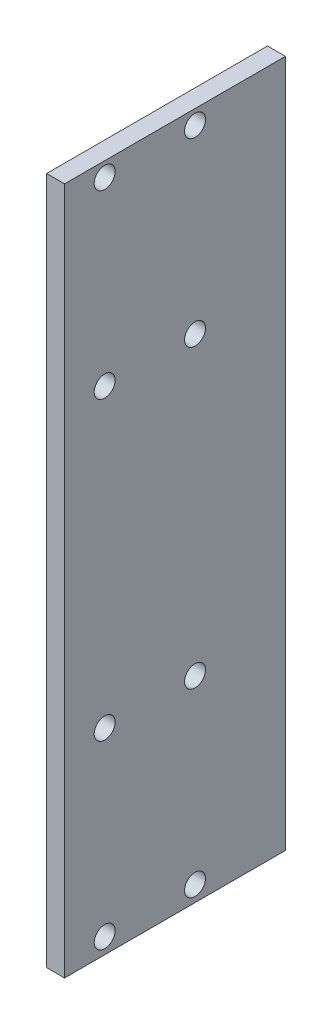
ISO-10303-21;
HEADER;
FILE_DESCRIPTION(('STEP AP214'),'2;1');
FILE_NAME('part.step','',(''),(''),'','','');
FILE_SCHEMA(('AUTOMOTIVE_DESIGN { 1 0 10303 214 1 1 1 1 }'));
ENDSEC;
DATA;
#1=APPLICATION_CONTEXT('core data for automotive mechanical design processes');
#2=APPLICATION_PROTOCOL_DEFINITION('international standard','automotive_design',2000,#1);
#3=PRODUCT_CONTEXT('',#1,'mechanical');
#4=PRODUCT('Part','Part','',(#3));
#5=PRODUCT_RELATED_PRODUCT_CATEGORY('part','',(#4));
#6=PRODUCT_DEFINITION_FORMATION('','',#4);
#7=PRODUCT_DEFINITION_CONTEXT('part definition',#1,'design');
#8=PRODUCT_DEFINITION('design','',#6,#7);
#9=PRODUCT_DEFINITION_SHAPE('','',#8);
#10=(LENGTH_UNIT() NAMED_UNIT(*) SI_UNIT(.MILLI.,.METRE.));
#11=(NAMED_UNIT(*) PLANE_ANGLE_UNIT() SI_UNIT($,.RADIAN.));
#12=(NAMED_UNIT(*) SI_UNIT($,.STERADIAN.) SOLID_ANGLE_UNIT());
#13=UNCERTAINTY_MEASURE_WITH_UNIT(LENGTH_MEASURE(1.E-05),#10,'distance_accuracy_value','');
#14=(GEOMETRIC_REPRESENTATION_CONTEXT(3) GLOBAL_UNCERTAINTY_ASSIGNED_CONTEXT((#13)) GLOBAL_UNIT_ASSIGNED_CONTEXT((#10,
#11,#12)) REPRESENTATION_CONTEXT('',''));
#15=CARTESIAN_POINT('',(0.,0.,0.));
#16=DIRECTION('',(0.,0.,1.));
#17=DIRECTION('',(1.,0.,0.));
#18=AXIS2_PLACEMENT_3D('',#15,#16,#17);
#19=CARTESIAN_POINT('',(3.175,0.,0.));
#20=DIRECTION('',(-1.,0.,0.));
#21=DIRECTION('',(0.,0.,1.));
#22=AXIS2_PLACEMENT_3D('',#19,#20,#21);
#23=PLANE('',#22);
#24=DIRECTION('',(0.,-1.,0.));
#25=VECTOR('',#24,1.);
#26=CARTESIAN_POINT('',(3.175,-18.795999999999,82.));
#27=LINE('',#26,#25);
#28=CARTESIAN_POINT('',(3.175,103.,82.));
#29=VERTEX_POINT('',#28);
#30=CARTESIAN_POINT('',(3.175,-18.795999999999,82.));
#31=VERTEX_POINT('',#30);
#32=EDGE_CURVE('E85',#29,#31,#27,.T.);
#33=ORIENTED_EDGE('',*,*,#32,.T.);
#34=DIRECTION('',(0.,0.,-1.));
#35=VECTOR('',#34,1.);
#36=CARTESIAN_POINT('',(3.175,-18.795999999999,82.));
#37=LINE('',#36,#35);
#38=CARTESIAN_POINT('',(3.175,-18.795999999999,42.8868));
#39=VERTEX_POINT('',#38);
#40=EDGE_CURVE('E80',#31,#39,#37,.T.);
#41=ORIENTED_EDGE('',*,*,#40,.T.);
#42=DIRECTION('',(0.,1.,0.));
#43=VECTOR('',#42,1.);
#44=CARTESIAN_POINT('',(3.175,-18.795999999999,42.8868));
#45=LINE('',#44,#43);
#46=CARTESIAN_POINT('',(3.175,103.,42.8868));
#47=VERTEX_POINT('',#46);
#48=EDGE_CURVE('E83',#39,#47,#45,.T.);
#49=ORIENTED_EDGE('',*,*,#48,.T.);
#50=DIRECTION('',(0.,0.,1.));
#51=VECTOR('',#50,1.);
#52=CARTESIAN_POINT('',(3.175,103.,82.));
#53=LINE('',#52,#51);
#54=EDGE_CURVE('E50',#47,#29,#53,.T.);
#55=ORIENTED_EDGE('',*,*,#54,.T.);
#56=EDGE_LOOP('',(#33,#41,#49,#55));
#57=FACE_BOUND('',#56,.T.);
#58=CARTESIAN_POINT('',(3.175,-16.000000003999,74.8897999999996));
#59=DIRECTION('',(1.,0.,0.));
#60=DIRECTION('',(0.,0.,-1.));
#61=AXIS2_PLACEMENT_3D('',#58,#59,#60);
#62=CIRCLE('',#61,1.8542);
#63=CARTESIAN_POINT('',(3.175,-16.000000003999,73.0355999999996));
#64=VERTEX_POINT('',#63);
#65=EDGE_CURVE('E100',#64,#64,#62,.T.);
#66=ORIENTED_EDGE('',*,*,#65,.F.);
#67=EDGE_LOOP('',(#66));
#68=FACE_BOUND('',#67,.T.);
#69=CARTESIAN_POINT('',(3.175,-16.000000003999,58.8897999999996));
#70=DIRECTION('',(1.,0.,0.));
#71=DIRECTION('',(0.,0.,-1.));
#72=AXIS2_PLACEMENT_3D('',#69,#70,#71);
#73=CIRCLE('',#72,1.8542);
#74=CARTESIAN_POINT('',(3.175,-16.000000003999,57.0355999999996));
#75=VERTEX_POINT('',#74);
#76=EDGE_CURVE('E115',#75,#75,#73,.T.);
#77=ORIENTED_EDGE('',*,*,#76,.F.);
#78=EDGE_LOOP('',(#77));
#79=FACE_BOUND('',#78,.T.);
#80=CARTESIAN_POINT('',(3.175,16.000000004001,74.8897999999996));
#81=DIRECTION('',(1.,0.,0.));
#82=DIRECTION('',(0.,0.,-1.));
#83=AXIS2_PLACEMENT_3D('',#80,#81,#82);
#84=CIRCLE('',#83,1.8542);
#85=CARTESIAN_POINT('',(3.175,16.000000004001,73.0355999999996));
#86=VERTEX_POINT('',#85);
#87=EDGE_CURVE('E121',#86,#86,#84,.T.);
#88=ORIENTED_EDGE('',*,*,#87,.F.);
#89=EDGE_LOOP('',(#88));
#90=FACE_BOUND('',#89,.T.);
#91=CARTESIAN_POINT('',(3.175,16.000000004001,58.8897999999996));
#92=DIRECTION('',(1.,0.,0.));
#93=DIRECTION('',(0.,0.,-1.));
#94=AXIS2_PLACEMENT_3D('',#91,#92,#93);
#95=CIRCLE('',#94,1.8542);
#96=CARTESIAN_POINT('',(3.175,16.000000004001,57.0355999999996));
#97=VERTEX_POINT('',#96);
#98=EDGE_CURVE('E127',#97,#97,#95,.T.);
#99=ORIENTED_EDGE('',*,*,#98,.F.);
#100=EDGE_LOOP('',(#99));
#101=FACE_BOUND('',#100,.T.);
#102=CARTESIAN_POINT('',(3.175,100.431124448718,74.8898000000564));
#103=DIRECTION('',(1.,0.,0.));
#104=DIRECTION('',(0.,0.,-1.));
#105=AXIS2_PLACEMENT_3D('',#102,#103,#104);
#106=CIRCLE('',#105,1.8542);
#107=CARTESIAN_POINT('',(3.175,100.431124448718,73.0356000000564));
#108=VERTEX_POINT('',#107);
#109=EDGE_CURVE('E133',#108,#108,#106,.T.);
#110=ORIENTED_EDGE('',*,*,#109,.F.);
#111=EDGE_LOOP('',(#110));
#112=FACE_BOUND('',#111,.T.);
#113=CARTESIAN_POINT('',(3.175,100.431124448718,58.8898000000564));
#114=DIRECTION('',(1.,0.,0.));
#115=DIRECTION('',(0.,0.,-1.));
#116=AXIS2_PLACEMENT_3D('',#113,#114,#115);
#117=CIRCLE('',#116,1.8542);
#118=CARTESIAN_POINT('',(3.175,100.431124448718,57.0356000000564));
#119=VERTEX_POINT('',#118);
#120=EDGE_CURVE('E139',#119,#119,#117,.T.);
#121=ORIENTED_EDGE('',*,*,#120,.F.);
#122=EDGE_LOOP('',(#121));
#123=FACE_BOUND('',#122,.T.);
#124=CARTESIAN_POINT('',(3.175,68.4311244407181,74.8898000000946));
#125=DIRECTION('',(1.,0.,0.));
#126=DIRECTION('',(0.,0.,-1.));
#127=AXIS2_PLACEMENT_3D('',#124,#125,#126);
#128=CIRCLE('',#127,1.8542);
#129=CARTESIAN_POINT('',(3.175,68.4311244407181,73.0356000000946));
#130=VERTEX_POINT('',#129);
#131=EDGE_CURVE('E145',#130,#130,#128,.T.);
#132=ORIENTED_EDGE('',*,*,#131,.F.);
#133=EDGE_LOOP('',(#132));
#134=FACE_BOUND('',#133,.T.);
#135=CARTESIAN_POINT('',(3.175,68.4311244407181,58.8898000000182));
#136=DIRECTION('',(1.,0.,0.));
#137=DIRECTION('',(0.,0.,-1.));
#138=AXIS2_PLACEMENT_3D('',#135,#136,#137);
#139=CIRCLE('',#138,1.8542);
#140=CARTESIAN_POINT('',(3.175,68.4311244407181,57.0356000000182));
#141=VERTEX_POINT('',#140);
#142=EDGE_CURVE('E151',#141,#141,#139,.T.);
#143=ORIENTED_EDGE('',*,*,#142,.F.);
#144=EDGE_LOOP('',(#143));
#145=FACE_BOUND('',#144,.T.);
#146=ADVANCED_FACE('F33',(#57,#68,#79,#90,#101,#112,#123,#134,#145),#23,.F.);
#147=CARTESIAN_POINT('',(0.,0.,0.));
#148=DIRECTION('',(-1.,0.,0.));
#149=DIRECTION('',(0.,0.,1.));
#150=AXIS2_PLACEMENT_3D('',#147,#148,#149);
#151=PLANE('',#150);
#152=CARTESIAN_POINT('',(0.,68.4311244407181,74.8898000000946));
#153=DIRECTION('',(1.,0.,0.));
#154=DIRECTION('',(0.,0.,-1.));
#155=AXIS2_PLACEMENT_3D('',#152,#153,#154);
#156=CIRCLE('',#155,1.8542);
#157=CARTESIAN_POINT('',(0.,68.4311244407181,73.0356000000946));
#158=VERTEX_POINT('',#157);
#159=EDGE_CURVE('E148',#158,#158,#156,.T.);
#160=ORIENTED_EDGE('',*,*,#159,.T.);
#161=EDGE_LOOP('',(#160));
#162=FACE_BOUND('',#161,.T.);
#163=CARTESIAN_POINT('',(0.,100.431124448718,74.8898000000564));
#164=DIRECTION('',(1.,0.,0.));
#165=DIRECTION('',(0.,0.,-1.));
#166=AXIS2_PLACEMENT_3D('',#163,#164,#165);
#167=CIRCLE('',#166,1.8542);
#168=CARTESIAN_POINT('',(0.,100.431124448718,73.0356000000564));
#169=VERTEX_POINT('',#168);
#170=EDGE_CURVE('E136',#169,#169,#167,.T.);
#171=ORIENTED_EDGE('',*,*,#170,.T.);
#172=EDGE_LOOP('',(#171));
#173=FACE_BOUND('',#172,.T.);
#174=CARTESIAN_POINT('',(0.,16.000000004001,74.8897999999996));
#175=DIRECTION('',(1.,0.,0.));
#176=DIRECTION('',(0.,0.,-1.));
#177=AXIS2_PLACEMENT_3D('',#174,#175,#176);
#178=CIRCLE('',#177,1.8542);
#179=CARTESIAN_POINT('',(0.,16.000000004001,73.0355999999996));
#180=VERTEX_POINT('',#179);
#181=EDGE_CURVE('E124',#180,#180,#178,.T.);
#182=ORIENTED_EDGE('',*,*,#181,.T.);
#183=EDGE_LOOP('',(#182));
#184=FACE_BOUND('',#183,.T.);
#185=CARTESIAN_POINT('',(0.,-16.000000003999,74.8897999999996));
#186=DIRECTION('',(1.,0.,0.));
#187=DIRECTION('',(0.,0.,-1.));
#188=AXIS2_PLACEMENT_3D('',#185,#186,#187);
#189=CIRCLE('',#188,1.8542);
#190=CARTESIAN_POINT('',(0.,-16.000000003999,73.0355999999996));
#191=VERTEX_POINT('',#190);
#192=EDGE_CURVE('E112',#191,#191,#189,.T.);
#193=ORIENTED_EDGE('',*,*,#192,.T.);
#194=EDGE_LOOP('',(#193));
#195=FACE_BOUND('',#194,.T.);
#196=DIRECTION('',(0.,-1.,0.));
#197=VECTOR('',#196,1.);
#198=CARTESIAN_POINT('',(0.,-18.795999999999,82.));
#199=LINE('',#198,#197);
#200=CARTESIAN_POINT('',(0.,103.,82.));
#201=VERTEX_POINT('',#200);
#202=CARTESIAN_POINT('',(0.,-18.795999999999,82.));
#203=VERTEX_POINT('',#202);
#204=EDGE_CURVE('E97',#201,#203,#199,.T.);
#205=ORIENTED_EDGE('',*,*,#204,.F.);
#206=DIRECTION('',(0.,0.,1.));
#207=VECTOR('',#206,1.);
#208=CARTESIAN_POINT('',(0.,103.,82.));
#209=LINE('',#208,#207);
#210=CARTESIAN_POINT('',(0.,103.,42.8868));
#211=VERTEX_POINT('',#210);
#212=EDGE_CURVE('E73',#211,#201,#209,.T.);
#213=ORIENTED_EDGE('',*,*,#212,.F.);
#214=DIRECTION('',(0.,1.,0.));
#215=VECTOR('',#214,1.);
#216=CARTESIAN_POINT('',(0.,-18.795999999999,42.8868));
#217=LINE('',#216,#215);
#218=CARTESIAN_POINT('',(0.,-18.795999999999,42.8868));
#219=VERTEX_POINT('',#218);
#220=EDGE_CURVE('E67',#219,#211,#217,.T.);
#221=ORIENTED_EDGE('',*,*,#220,.F.);
#222=DIRECTION('',(0.,0.,-1.));
#223=VECTOR('',#222,1.);
#224=CARTESIAN_POINT('',(0.,-18.795999999999,82.));
#225=LINE('',#224,#223);
#226=EDGE_CURVE('E89',#203,#219,#225,.T.);
#227=ORIENTED_EDGE('',*,*,#226,.F.);
#228=EDGE_LOOP('',(#205,#213,#221,#227));
#229=FACE_BOUND('',#228,.T.);
#230=CARTESIAN_POINT('',(0.,-16.000000003999,58.8897999999996));
#231=DIRECTION('',(1.,0.,0.));
#232=DIRECTION('',(0.,0.,-1.));
#233=AXIS2_PLACEMENT_3D('',#230,#231,#232);
#234=CIRCLE('',#233,1.8542);
#235=CARTESIAN_POINT('',(0.,-16.000000003999,57.0355999999996));
#236=VERTEX_POINT('',#235);
#237=EDGE_CURVE('E118',#236,#236,#234,.T.);
#238=ORIENTED_EDGE('',*,*,#237,.T.);
#239=EDGE_LOOP('',(#238));
#240=FACE_BOUND('',#239,.T.);
#241=CARTESIAN_POINT('',(0.,16.000000004001,58.8897999999996));
#242=DIRECTION('',(1.,0.,0.));
#243=DIRECTION('',(0.,0.,-1.));
#244=AXIS2_PLACEMENT_3D('',#241,#242,#243);
#245=CIRCLE('',#244,1.8542);
#246=CARTESIAN_POINT('',(0.,16.000000004001,57.0355999999996));
#247=VERTEX_POINT('',#246);
#248=EDGE_CURVE('E130',#247,#247,#245,.T.);
#249=ORIENTED_EDGE('',*,*,#248,.T.);
#250=EDGE_LOOP('',(#249));
#251=FACE_BOUND('',#250,.T.);
#252=CARTESIAN_POINT('',(0.,100.431124448718,58.8898000000564));
#253=DIRECTION('',(1.,0.,0.));
#254=DIRECTION('',(0.,0.,-1.));
#255=AXIS2_PLACEMENT_3D('',#252,#253,#254);
#256=CIRCLE('',#255,1.8542);
#257=CARTESIAN_POINT('',(0.,100.431124448718,57.0356000000564));
#258=VERTEX_POINT('',#257);
#259=EDGE_CURVE('E142',#258,#258,#256,.T.);
#260=ORIENTED_EDGE('',*,*,#259,.T.);
#261=EDGE_LOOP('',(#260));
#262=FACE_BOUND('',#261,.T.);
#263=CARTESIAN_POINT('',(0.,68.4311244407181,58.8898000000182));
#264=DIRECTION('',(1.,0.,0.));
#265=DIRECTION('',(0.,0.,-1.));
#266=AXIS2_PLACEMENT_3D('',#263,#264,#265);
#267=CIRCLE('',#266,1.8542);
#268=CARTESIAN_POINT('',(0.,68.4311244407181,57.0356000000182));
#269=VERTEX_POINT('',#268);
#270=EDGE_CURVE('E154',#269,#269,#267,.T.);
#271=ORIENTED_EDGE('',*,*,#270,.T.);
#272=EDGE_LOOP('',(#271));
#273=FACE_BOUND('',#272,.T.);
#274=ADVANCED_FACE('F108',(#162,#173,#184,#195,#229,#240,#251,#262,#273),#151,.T.);
#275=CARTESIAN_POINT('',(3.175,-18.795999999999,82.));
#276=DIRECTION('',(0.,0.,-1.));
#277=DIRECTION('',(-1.,0.,0.));
#278=AXIS2_PLACEMENT_3D('',#275,#276,#277);
#279=PLANE('',#278);
#280=ORIENTED_EDGE('',*,*,#204,.T.);
#281=DIRECTION('',(-1.,0.,0.));
#282=VECTOR('',#281,1.);
#283=CARTESIAN_POINT('',(3.175,-18.795999999999,82.));
#284=LINE('',#283,#282);
#285=EDGE_CURVE('E11',#31,#203,#284,.T.);
#286=ORIENTED_EDGE('',*,*,#285,.F.);
#287=ORIENTED_EDGE('',*,*,#32,.F.);
#288=DIRECTION('',(-1.,0.,0.));
#289=VECTOR('',#288,1.);
#290=CARTESIAN_POINT('',(3.175,103.,82.));
#291=LINE('',#290,#289);
#292=EDGE_CURVE('E93',#29,#201,#291,.T.);
#293=ORIENTED_EDGE('',*,*,#292,.T.);
#294=EDGE_LOOP('',(#280,#286,#287,#293));
#295=FACE_BOUND('',#294,.T.);
#296=ADVANCED_FACE('F35',(#295),#279,.F.);
#297=CARTESIAN_POINT('',(3.175,-18.795999999999,82.));
#298=DIRECTION('',(0.,1.,0.));
#299=DIRECTION('',(0.,0.,1.));
#300=AXIS2_PLACEMENT_3D('',#297,#298,#299);
#301=PLANE('',#300);
#302=ORIENTED_EDGE('',*,*,#226,.T.);
#303=DIRECTION('',(-1.,0.,0.));
#304=VECTOR('',#303,1.);
#305=CARTESIAN_POINT('',(3.175,-18.795999999999,42.8868));
#306=LINE('',#305,#304);
#307=EDGE_CURVE('E42',#39,#219,#306,.T.);
#308=ORIENTED_EDGE('',*,*,#307,.F.);
#309=ORIENTED_EDGE('',*,*,#40,.F.);
#310=ORIENTED_EDGE('',*,*,#285,.T.);
#311=EDGE_LOOP('',(#302,#308,#309,#310));
#312=FACE_BOUND('',#311,.T.);
#313=ADVANCED_FACE('F88',(#312),#301,.F.);
#314=CARTESIAN_POINT('',(3.175,-18.795999999999,42.8868));
#315=DIRECTION('',(0.,0.,1.));
#316=DIRECTION('',(1.,0.,0.));
#317=AXIS2_PLACEMENT_3D('',#314,#315,#316);
#318=PLANE('',#317);
#319=ORIENTED_EDGE('',*,*,#220,.T.);
#320=DIRECTION('',(-1.,0.,0.));
#321=VECTOR('',#320,1.);
#322=CARTESIAN_POINT('',(3.175,103.,42.8868));
#323=LINE('',#322,#321);
#324=EDGE_CURVE('E90',#47,#211,#323,.T.);
#325=ORIENTED_EDGE('',*,*,#324,.F.);
#326=ORIENTED_EDGE('',*,*,#48,.F.);
#327=ORIENTED_EDGE('',*,*,#307,.T.);
#328=EDGE_LOOP('',(#319,#325,#326,#327));
#329=FACE_BOUND('',#328,.T.);
#330=ADVANCED_FACE('F91',(#329),#318,.F.);
#331=CARTESIAN_POINT('',(3.175,103.,82.));
#332=DIRECTION('',(0.,-1.,0.));
#333=DIRECTION('',(0.,0.,-1.));
#334=AXIS2_PLACEMENT_3D('',#331,#332,#333);
#335=PLANE('',#334);
#336=ORIENTED_EDGE('',*,*,#212,.T.);
#337=ORIENTED_EDGE('',*,*,#292,.F.);
#338=ORIENTED_EDGE('',*,*,#54,.F.);
#339=ORIENTED_EDGE('',*,*,#324,.T.);
#340=EDGE_LOOP('',(#336,#337,#338,#339));
#341=FACE_BOUND('',#340,.T.);
#342=ADVANCED_FACE('F105',(#341),#335,.F.);
#343=CARTESIAN_POINT('',(3.175,-16.000000003999,74.8897999999996));
#344=DIRECTION('',(-1.,0.,0.));
#345=DIRECTION('',(0.,0.,1.));
#346=AXIS2_PLACEMENT_3D('',#343,#344,#345);
#347=CYLINDRICAL_SURFACE('',#346,1.8542);
#348=ORIENTED_EDGE('',*,*,#65,.T.);
#349=EDGE_LOOP('',(#348));
#350=FACE_BOUND('',#349,.T.);
#351=ORIENTED_EDGE('',*,*,#192,.F.);
#352=EDGE_LOOP('',(#351));
#353=FACE_BOUND('',#352,.T.);
#354=ADVANCED_FACE('F171',(#350,#353),#347,.F.);
#355=CARTESIAN_POINT('',(3.175,-16.000000003999,58.8897999999996));
#356=DIRECTION('',(-1.,0.,0.));
#357=DIRECTION('',(0.,0.,1.));
#358=AXIS2_PLACEMENT_3D('',#355,#356,#357);
#359=CYLINDRICAL_SURFACE('',#358,1.8542);
#360=ORIENTED_EDGE('',*,*,#76,.T.);
#361=EDGE_LOOP('',(#360));
#362=FACE_BOUND('',#361,.T.);
#363=ORIENTED_EDGE('',*,*,#237,.F.);
#364=EDGE_LOOP('',(#363));
#365=FACE_BOUND('',#364,.T.);
#366=ADVANCED_FACE('F217',(#362,#365),#359,.F.);
#367=CARTESIAN_POINT('',(3.175,16.000000004001,74.8897999999996));
#368=DIRECTION('',(-1.,0.,0.));
#369=DIRECTION('',(0.,0.,1.));
#370=AXIS2_PLACEMENT_3D('',#367,#368,#369);
#371=CYLINDRICAL_SURFACE('',#370,1.8542);
#372=ORIENTED_EDGE('',*,*,#87,.T.);
#373=EDGE_LOOP('',(#372));
#374=FACE_BOUND('',#373,.T.);
#375=ORIENTED_EDGE('',*,*,#181,.F.);
#376=EDGE_LOOP('',(#375));
#377=FACE_BOUND('',#376,.T.);
#378=ADVANCED_FACE('F225',(#374,#377),#371,.F.);
#379=CARTESIAN_POINT('',(3.175,16.000000004001,58.8897999999996));
#380=DIRECTION('',(-1.,0.,0.));
#381=DIRECTION('',(0.,0.,1.));
#382=AXIS2_PLACEMENT_3D('',#379,#380,#381);
#383=CYLINDRICAL_SURFACE('',#382,1.8542);
#384=ORIENTED_EDGE('',*,*,#98,.T.);
#385=EDGE_LOOP('',(#384));
#386=FACE_BOUND('',#385,.T.);
#387=ORIENTED_EDGE('',*,*,#248,.F.);
#388=EDGE_LOOP('',(#387));
#389=FACE_BOUND('',#388,.T.);
#390=ADVANCED_FACE('F233',(#386,#389),#383,.F.);
#391=CARTESIAN_POINT('',(3.175,100.431124448718,74.8898000000564));
#392=DIRECTION('',(-1.,0.,0.));
#393=DIRECTION('',(0.,0.,1.));
#394=AXIS2_PLACEMENT_3D('',#391,#392,#393);
#395=CYLINDRICAL_SURFACE('',#394,1.8542);
#396=ORIENTED_EDGE('',*,*,#109,.T.);
#397=EDGE_LOOP('',(#396));
#398=FACE_BOUND('',#397,.T.);
#399=ORIENTED_EDGE('',*,*,#170,.F.);
#400=EDGE_LOOP('',(#399));
#401=FACE_BOUND('',#400,.T.);
#402=ADVANCED_FACE('F242',(#398,#401),#395,.F.);
#403=CARTESIAN_POINT('',(3.175,100.431124448718,58.8898000000564));
#404=DIRECTION('',(-1.,0.,0.));
#405=DIRECTION('',(0.,0.,1.));
#406=AXIS2_PLACEMENT_3D('',#403,#404,#405);
#407=CYLINDRICAL_SURFACE('',#406,1.8542);
#408=ORIENTED_EDGE('',*,*,#120,.T.);
#409=EDGE_LOOP('',(#408));
#410=FACE_BOUND('',#409,.T.);
#411=ORIENTED_EDGE('',*,*,#259,.F.);
#412=EDGE_LOOP('',(#411));
#413=FACE_BOUND('',#412,.T.);
#414=ADVANCED_FACE('F251',(#410,#413),#407,.F.);
#415=CARTESIAN_POINT('',(3.175,68.4311244407181,74.8898000000946));
#416=DIRECTION('',(-1.,0.,0.));
#417=DIRECTION('',(0.,0.,1.));
#418=AXIS2_PLACEMENT_3D('',#415,#416,#417);
#419=CYLINDRICAL_SURFACE('',#418,1.8542);
#420=ORIENTED_EDGE('',*,*,#131,.T.);
#421=EDGE_LOOP('',(#420));
#422=FACE_BOUND('',#421,.T.);
#423=ORIENTED_EDGE('',*,*,#159,.F.);
#424=EDGE_LOOP('',(#423));
#425=FACE_BOUND('',#424,.T.);
#426=ADVANCED_FACE('F260',(#422,#425),#419,.F.);
#427=CARTESIAN_POINT('',(3.175,68.4311244407181,58.8898000000182));
#428=DIRECTION('',(-1.,0.,0.));
#429=DIRECTION('',(0.,0.,1.));
#430=AXIS2_PLACEMENT_3D('',#427,#428,#429);
#431=CYLINDRICAL_SURFACE('',#430,1.8542);
#432=ORIENTED_EDGE('',*,*,#142,.T.);
#433=EDGE_LOOP('',(#432));
#434=FACE_BOUND('',#433,.T.);
#435=ORIENTED_EDGE('',*,*,#270,.F.);
#436=EDGE_LOOP('',(#435));
#437=FACE_BOUND('',#436,.T.);
#438=ADVANCED_FACE('F160',(#434,#437),#431,.F.);
#439=CLOSED_SHELL('',(#146,#274,#296,#313,#330,#342,#354,#366,#378,#390,#402,#414,#426,#438));
#440=MANIFOLD_SOLID_BREP('B2',#439);
#441=ADVANCED_BREP_SHAPE_REPRESENTATION('',(#18,#440),#14);
#442=SHAPE_DEFINITION_REPRESENTATION(#9,#441);
ENDSEC;
END-ISO-10303-21;
